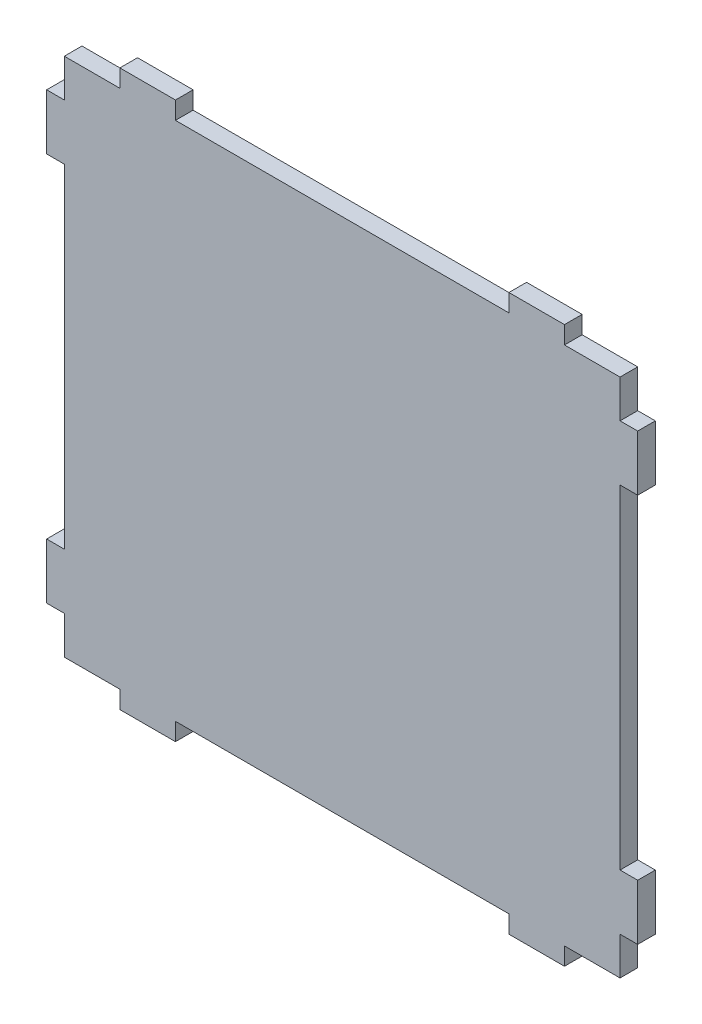
ISO-10303-21;
HEADER;
FILE_DESCRIPTION(('STEP AP214'),'2;1');
FILE_NAME('part.step','',(''),(''),'','','');
FILE_SCHEMA(('AUTOMOTIVE_DESIGN { 1 0 10303 214 1 1 1 1 }'));
ENDSEC;
DATA;
#1=APPLICATION_CONTEXT('core data for automotive mechanical design processes');
#2=APPLICATION_PROTOCOL_DEFINITION('international standard','automotive_design',2000,#1);
#3=PRODUCT_CONTEXT('',#1,'mechanical');
#4=PRODUCT('Part','Part','',(#3));
#5=PRODUCT_RELATED_PRODUCT_CATEGORY('part','',(#4));
#6=PRODUCT_DEFINITION_FORMATION('','',#4);
#7=PRODUCT_DEFINITION_CONTEXT('part definition',#1,'design');
#8=PRODUCT_DEFINITION('design','',#6,#7);
#9=PRODUCT_DEFINITION_SHAPE('','',#8);
#10=(LENGTH_UNIT() NAMED_UNIT(*) SI_UNIT(.MILLI.,.METRE.));
#11=(NAMED_UNIT(*) PLANE_ANGLE_UNIT() SI_UNIT($,.RADIAN.));
#12=(NAMED_UNIT(*) SI_UNIT($,.STERADIAN.) SOLID_ANGLE_UNIT());
#13=UNCERTAINTY_MEASURE_WITH_UNIT(LENGTH_MEASURE(1.E-05),#10,'distance_accuracy_value','');
#14=(GEOMETRIC_REPRESENTATION_CONTEXT(3) GLOBAL_UNCERTAINTY_ASSIGNED_CONTEXT((#13)) GLOBAL_UNIT_ASSIGNED_CONTEXT((#10,
#11,#12)) REPRESENTATION_CONTEXT('',''));
#15=CARTESIAN_POINT('',(0.,0.,0.));
#16=DIRECTION('',(0.,0.,1.));
#17=DIRECTION('',(1.,0.,0.));
#18=AXIS2_PLACEMENT_3D('',#15,#16,#17);
#19=CARTESIAN_POINT('',(10.,96.825,3.175));
#20=DIRECTION('',(1.,0.,0.));
#21=DIRECTION('',(0.,0.,-1.));
#22=AXIS2_PLACEMENT_3D('',#19,#20,#21);
#23=PLANE('',#22);
#24=DIRECTION('',(0.,-1.,0.));
#25=VECTOR('',#24,1.);
#26=CARTESIAN_POINT('',(10.,96.825,0.));
#27=LINE('',#26,#25);
#28=CARTESIAN_POINT('',(10.,100.,0.));
#29=VERTEX_POINT('',#28);
#30=CARTESIAN_POINT('',(10.,96.825,0.));
#31=VERTEX_POINT('',#30);
#32=EDGE_CURVE('E575',#29,#31,#27,.T.);
#33=ORIENTED_EDGE('',*,*,#32,.T.);
#34=DIRECTION('',(0.,0.,-1.));
#35=VECTOR('',#34,1.);
#36=CARTESIAN_POINT('',(10.,96.825,3.175));
#37=LINE('',#36,#35);
#38=CARTESIAN_POINT('',(10.,96.825,3.175));
#39=VERTEX_POINT('',#38);
#40=EDGE_CURVE('E12',#39,#31,#37,.T.);
#41=ORIENTED_EDGE('',*,*,#40,.F.);
#42=DIRECTION('',(0.,-1.,0.));
#43=VECTOR('',#42,1.);
#44=CARTESIAN_POINT('',(10.,96.825,3.175));
#45=LINE('',#44,#43);
#46=CARTESIAN_POINT('',(10.,100.,3.175));
#47=VERTEX_POINT('',#46);
#48=EDGE_CURVE('E456',#47,#39,#45,.T.);
#49=ORIENTED_EDGE('',*,*,#48,.F.);
#50=DIRECTION('',(0.,0.,-1.));
#51=VECTOR('',#50,1.);
#52=CARTESIAN_POINT('',(10.,100.,3.175));
#53=LINE('',#52,#51);
#54=EDGE_CURVE('E298',#47,#29,#53,.T.);
#55=ORIENTED_EDGE('',*,*,#54,.T.);
#56=EDGE_LOOP('',(#33,#41,#49,#55));
#57=FACE_BOUND('',#56,.T.);
#58=ADVANCED_FACE('F35',(#57),#23,.F.);
#59=CARTESIAN_POINT('',(10.,96.825,3.175));
#60=DIRECTION('',(0.,-1.,0.));
#61=DIRECTION('',(0.,0.,-1.));
#62=AXIS2_PLACEMENT_3D('',#59,#60,#61);
#63=PLANE('',#62);
#64=DIRECTION('',(-1.,0.,0.));
#65=VECTOR('',#64,1.);
#66=CARTESIAN_POINT('',(10.,96.825,0.));
#67=LINE('',#66,#65);
#68=CARTESIAN_POINT('',(0.,96.825,0.));
#69=VERTEX_POINT('',#68);
#70=EDGE_CURVE('E569',#31,#69,#67,.T.);
#71=ORIENTED_EDGE('',*,*,#70,.T.);
#72=DIRECTION('',(0.,0.,-1.));
#73=VECTOR('',#72,1.);
#74=CARTESIAN_POINT('',(0.,96.825,3.175));
#75=LINE('',#74,#73);
#76=CARTESIAN_POINT('',(0.,96.825,3.175));
#77=VERTEX_POINT('',#76);
#78=EDGE_CURVE('E43',#77,#69,#75,.T.);
#79=ORIENTED_EDGE('',*,*,#78,.F.);
#80=DIRECTION('',(-1.,0.,0.));
#81=VECTOR('',#80,1.);
#82=CARTESIAN_POINT('',(10.,96.825,3.175));
#83=LINE('',#82,#81);
#84=EDGE_CURVE('E178',#39,#77,#83,.T.);
#85=ORIENTED_EDGE('',*,*,#84,.F.);
#86=ORIENTED_EDGE('',*,*,#40,.T.);
#87=EDGE_LOOP('',(#71,#79,#85,#86));
#88=FACE_BOUND('',#87,.T.);
#89=ADVANCED_FACE('F652',(#88),#63,.F.);
#90=CARTESIAN_POINT('',(0.,90.,3.175));
#91=DIRECTION('',(1.,0.,0.));
#92=DIRECTION('',(0.,1.,0.));
#93=AXIS2_PLACEMENT_3D('',#90,#91,#92);
#94=PLANE('',#93);
#95=DIRECTION('',(0.,-1.,0.));
#96=VECTOR('',#95,1.);
#97=CARTESIAN_POINT('',(0.,90.,0.));
#98=LINE('',#97,#96);
#99=CARTESIAN_POINT('',(0.,90.,0.));
#100=VERTEX_POINT('',#99);
#101=EDGE_CURVE('E564',#69,#100,#98,.T.);
#102=ORIENTED_EDGE('',*,*,#101,.T.);
#103=DIRECTION('',(0.,0.,-1.));
#104=VECTOR('',#103,1.);
#105=CARTESIAN_POINT('',(0.,90.,3.175));
#106=LINE('',#105,#104);
#107=CARTESIAN_POINT('',(0.,90.,3.175));
#108=VERTEX_POINT('',#107);
#109=EDGE_CURVE('E556',#108,#100,#106,.T.);
#110=ORIENTED_EDGE('',*,*,#109,.F.);
#111=DIRECTION('',(0.,-1.,0.));
#112=VECTOR('',#111,1.);
#113=CARTESIAN_POINT('',(0.,90.,3.175));
#114=LINE('',#113,#112);
#115=EDGE_CURVE('E448',#77,#108,#114,.T.);
#116=ORIENTED_EDGE('',*,*,#115,.F.);
#117=ORIENTED_EDGE('',*,*,#78,.T.);
#118=EDGE_LOOP('',(#102,#110,#116,#117));
#119=FACE_BOUND('',#118,.T.);
#120=ADVANCED_FACE('F562',(#119),#94,.F.);
#121=CARTESIAN_POINT('',(0.,90.,3.175));
#122=DIRECTION('',(0.,-1.,0.));
#123=DIRECTION('',(0.,0.,-1.));
#124=AXIS2_PLACEMENT_3D('',#121,#122,#123);
#125=PLANE('',#124);
#126=DIRECTION('',(-1.,0.,0.));
#127=VECTOR('',#126,1.);
#128=CARTESIAN_POINT('',(0.,90.,0.));
#129=LINE('',#128,#127);
#130=CARTESIAN_POINT('',(-3.175,90.,0.));
#131=VERTEX_POINT('',#130);
#132=EDGE_CURVE('E571',#100,#131,#129,.T.);
#133=ORIENTED_EDGE('',*,*,#132,.T.);
#134=DIRECTION('',(0.,0.,-1.));
#135=VECTOR('',#134,1.);
#136=CARTESIAN_POINT('',(-3.175,90.,3.175));
#137=LINE('',#136,#135);
#138=CARTESIAN_POINT('',(-3.175,90.,3.175));
#139=VERTEX_POINT('',#138);
#140=EDGE_CURVE('E553',#139,#131,#137,.T.);
#141=ORIENTED_EDGE('',*,*,#140,.F.);
#142=DIRECTION('',(-1.,0.,0.));
#143=VECTOR('',#142,1.);
#144=CARTESIAN_POINT('',(0.,90.,3.175));
#145=LINE('',#144,#143);
#146=EDGE_CURVE('E444',#108,#139,#145,.T.);
#147=ORIENTED_EDGE('',*,*,#146,.F.);
#148=ORIENTED_EDGE('',*,*,#109,.T.);
#149=EDGE_LOOP('',(#133,#141,#147,#148));
#150=FACE_BOUND('',#149,.T.);
#151=ADVANCED_FACE('F659',(#150),#125,.F.);
#152=CARTESIAN_POINT('',(-3.175,90.,3.175));
#153=DIRECTION('',(1.,0.,0.));
#154=DIRECTION('',(0.,1.,0.));
#155=AXIS2_PLACEMENT_3D('',#152,#153,#154);
#156=PLANE('',#155);
#157=DIRECTION('',(0.,-1.,0.));
#158=VECTOR('',#157,1.);
#159=CARTESIAN_POINT('',(-3.175,90.,0.));
#160=LINE('',#159,#158);
#161=CARTESIAN_POINT('',(-3.175,80.,0.));
#162=VERTEX_POINT('',#161);
#163=EDGE_CURVE('E573',#131,#162,#160,.T.);
#164=ORIENTED_EDGE('',*,*,#163,.T.);
#165=DIRECTION('',(0.,0.,-1.));
#166=VECTOR('',#165,1.);
#167=CARTESIAN_POINT('',(-3.175,80.,3.175));
#168=LINE('',#167,#166);
#169=CARTESIAN_POINT('',(-3.175,80.,3.175));
#170=VERTEX_POINT('',#169);
#171=EDGE_CURVE('E550',#170,#162,#168,.T.);
#172=ORIENTED_EDGE('',*,*,#171,.F.);
#173=DIRECTION('',(0.,-1.,0.));
#174=VECTOR('',#173,1.);
#175=CARTESIAN_POINT('',(-3.175,90.,3.175));
#176=LINE('',#175,#174);
#177=EDGE_CURVE('E441',#139,#170,#176,.T.);
#178=ORIENTED_EDGE('',*,*,#177,.F.);
#179=ORIENTED_EDGE('',*,*,#140,.T.);
#180=EDGE_LOOP('',(#164,#172,#178,#179));
#181=FACE_BOUND('',#180,.T.);
#182=ADVANCED_FACE('F664',(#181),#156,.F.);
#183=CARTESIAN_POINT('',(0.,80.,3.175));
#184=DIRECTION('',(0.,1.,0.));
#185=DIRECTION('',(0.,0.,1.));
#186=AXIS2_PLACEMENT_3D('',#183,#184,#185);
#187=PLANE('',#186);
#188=DIRECTION('',(1.,0.,0.));
#189=VECTOR('',#188,1.);
#190=CARTESIAN_POINT('',(0.,80.,0.));
#191=LINE('',#190,#189);
#192=CARTESIAN_POINT('',(0.,80.,0.));
#193=VERTEX_POINT('',#192);
#194=EDGE_CURVE('E579',#162,#193,#191,.T.);
#195=ORIENTED_EDGE('',*,*,#194,.T.);
#196=DIRECTION('',(0.,0.,-1.));
#197=VECTOR('',#196,1.);
#198=CARTESIAN_POINT('',(0.,80.,3.175));
#199=LINE('',#198,#197);
#200=CARTESIAN_POINT('',(0.,80.,3.175));
#201=VERTEX_POINT('',#200);
#202=EDGE_CURVE('E547',#201,#193,#199,.T.);
#203=ORIENTED_EDGE('',*,*,#202,.F.);
#204=DIRECTION('',(1.,0.,0.));
#205=VECTOR('',#204,1.);
#206=CARTESIAN_POINT('',(0.,80.,3.175));
#207=LINE('',#206,#205);
#208=EDGE_CURVE('E433',#170,#201,#207,.T.);
#209=ORIENTED_EDGE('',*,*,#208,.F.);
#210=ORIENTED_EDGE('',*,*,#171,.T.);
#211=EDGE_LOOP('',(#195,#203,#209,#210));
#212=FACE_BOUND('',#211,.T.);
#213=ADVANCED_FACE('F668',(#212),#187,.F.);
#214=CARTESIAN_POINT('',(0.,80.,3.175));
#215=DIRECTION('',(1.,0.,0.));
#216=DIRECTION('',(0.,0.,-1.));
#217=AXIS2_PLACEMENT_3D('',#214,#215,#216);
#218=PLANE('',#217);
#219=DIRECTION('',(0.,-1.,0.));
#220=VECTOR('',#219,1.);
#221=CARTESIAN_POINT('',(0.,80.,0.));
#222=LINE('',#221,#220);
#223=CARTESIAN_POINT('',(0.,20.,0.));
#224=VERTEX_POINT('',#223);
#225=EDGE_CURVE('E581',#193,#224,#222,.T.);
#226=ORIENTED_EDGE('',*,*,#225,.T.);
#227=DIRECTION('',(0.,0.,-1.));
#228=VECTOR('',#227,1.);
#229=CARTESIAN_POINT('',(0.,20.,3.175));
#230=LINE('',#229,#228);
#231=CARTESIAN_POINT('',(0.,20.,3.175));
#232=VERTEX_POINT('',#231);
#233=EDGE_CURVE('E544',#232,#224,#230,.T.);
#234=ORIENTED_EDGE('',*,*,#233,.F.);
#235=DIRECTION('',(0.,-1.,0.));
#236=VECTOR('',#235,1.);
#237=CARTESIAN_POINT('',(0.,80.,3.175));
#238=LINE('',#237,#236);
#239=EDGE_CURVE('E429',#201,#232,#238,.T.);
#240=ORIENTED_EDGE('',*,*,#239,.F.);
#241=ORIENTED_EDGE('',*,*,#202,.T.);
#242=EDGE_LOOP('',(#226,#234,#240,#241));
#243=FACE_BOUND('',#242,.T.);
#244=ADVANCED_FACE('F672',(#243),#218,.F.);
#245=CARTESIAN_POINT('',(0.,20.,3.175));
#246=DIRECTION('',(0.,-1.,0.));
#247=DIRECTION('',(0.,0.,-1.));
#248=AXIS2_PLACEMENT_3D('',#245,#246,#247);
#249=PLANE('',#248);
#250=DIRECTION('',(-1.,0.,0.));
#251=VECTOR('',#250,1.);
#252=CARTESIAN_POINT('',(0.,20.,0.));
#253=LINE('',#252,#251);
#254=CARTESIAN_POINT('',(-3.175,20.,0.));
#255=VERTEX_POINT('',#254);
#256=EDGE_CURVE('E583',#224,#255,#253,.T.);
#257=ORIENTED_EDGE('',*,*,#256,.T.);
#258=DIRECTION('',(0.,0.,-1.));
#259=VECTOR('',#258,1.);
#260=CARTESIAN_POINT('',(-3.175,20.,3.175));
#261=LINE('',#260,#259);
#262=CARTESIAN_POINT('',(-3.175,20.,3.175));
#263=VERTEX_POINT('',#262);
#264=EDGE_CURVE('E541',#263,#255,#261,.T.);
#265=ORIENTED_EDGE('',*,*,#264,.F.);
#266=DIRECTION('',(-1.,0.,0.));
#267=VECTOR('',#266,1.);
#268=CARTESIAN_POINT('',(0.,20.,3.175));
#269=LINE('',#268,#267);
#270=EDGE_CURVE('E425',#232,#263,#269,.T.);
#271=ORIENTED_EDGE('',*,*,#270,.F.);
#272=ORIENTED_EDGE('',*,*,#233,.T.);
#273=EDGE_LOOP('',(#257,#265,#271,#272));
#274=FACE_BOUND('',#273,.T.);
#275=ADVANCED_FACE('F676',(#274),#249,.F.);
#276=CARTESIAN_POINT('',(-3.175,9.99999999999999,3.175));
#277=DIRECTION('',(1.,0.,0.));
#278=DIRECTION('',(0.,1.,0.));
#279=AXIS2_PLACEMENT_3D('',#276,#277,#278);
#280=PLANE('',#279);
#281=DIRECTION('',(0.,-1.,0.));
#282=VECTOR('',#281,1.);
#283=CARTESIAN_POINT('',(-3.175,9.99999999999999,0.));
#284=LINE('',#283,#282);
#285=CARTESIAN_POINT('',(-3.175,9.99999999999999,0.));
#286=VERTEX_POINT('',#285);
#287=EDGE_CURVE('E585',#255,#286,#284,.T.);
#288=ORIENTED_EDGE('',*,*,#287,.T.);
#289=DIRECTION('',(0.,0.,-1.));
#290=VECTOR('',#289,1.);
#291=CARTESIAN_POINT('',(-3.175,9.99999999999999,3.175));
#292=LINE('',#291,#290);
#293=CARTESIAN_POINT('',(-3.175,9.99999999999999,3.175));
#294=VERTEX_POINT('',#293);
#295=EDGE_CURVE('E538',#294,#286,#292,.T.);
#296=ORIENTED_EDGE('',*,*,#295,.F.);
#297=DIRECTION('',(0.,-1.,0.));
#298=VECTOR('',#297,1.);
#299=CARTESIAN_POINT('',(-3.175,9.99999999999999,3.175));
#300=LINE('',#299,#298);
#301=EDGE_CURVE('E422',#263,#294,#300,.T.);
#302=ORIENTED_EDGE('',*,*,#301,.F.);
#303=ORIENTED_EDGE('',*,*,#264,.T.);
#304=EDGE_LOOP('',(#288,#296,#302,#303));
#305=FACE_BOUND('',#304,.T.);
#306=ADVANCED_FACE('F680',(#305),#280,.F.);
#307=CARTESIAN_POINT('',(0.,9.99999999999999,3.175));
#308=DIRECTION('',(0.,1.,0.));
#309=DIRECTION('',(0.,0.,1.));
#310=AXIS2_PLACEMENT_3D('',#307,#308,#309);
#311=PLANE('',#310);
#312=DIRECTION('',(1.,0.,0.));
#313=VECTOR('',#312,1.);
#314=CARTESIAN_POINT('',(0.,9.99999999999999,0.));
#315=LINE('',#314,#313);
#316=CARTESIAN_POINT('',(0.,9.99999999999999,0.));
#317=VERTEX_POINT('',#316);
#318=EDGE_CURVE('E587',#286,#317,#315,.T.);
#319=ORIENTED_EDGE('',*,*,#318,.T.);
#320=DIRECTION('',(0.,0.,-1.));
#321=VECTOR('',#320,1.);
#322=CARTESIAN_POINT('',(0.,9.99999999999999,3.175));
#323=LINE('',#322,#321);
#324=CARTESIAN_POINT('',(0.,9.99999999999999,3.175));
#325=VERTEX_POINT('',#324);
#326=EDGE_CURVE('E535',#325,#317,#323,.T.);
#327=ORIENTED_EDGE('',*,*,#326,.F.);
#328=DIRECTION('',(1.,0.,0.));
#329=VECTOR('',#328,1.);
#330=CARTESIAN_POINT('',(0.,9.99999999999999,3.175));
#331=LINE('',#330,#329);
#332=EDGE_CURVE('E414',#294,#325,#331,.T.);
#333=ORIENTED_EDGE('',*,*,#332,.F.);
#334=ORIENTED_EDGE('',*,*,#295,.T.);
#335=EDGE_LOOP('',(#319,#327,#333,#334));
#336=FACE_BOUND('',#335,.T.);
#337=ADVANCED_FACE('F684',(#336),#311,.F.);
#338=CARTESIAN_POINT('',(0.,9.99999999999999,3.175));
#339=DIRECTION('',(1.,0.,0.));
#340=DIRECTION('',(0.,1.,0.));
#341=AXIS2_PLACEMENT_3D('',#338,#339,#340);
#342=PLANE('',#341);
#343=DIRECTION('',(0.,-1.,0.));
#344=VECTOR('',#343,1.);
#345=CARTESIAN_POINT('',(0.,9.99999999999999,0.));
#346=LINE('',#345,#344);
#347=CARTESIAN_POINT('',(0.,3.175,0.));
#348=VERTEX_POINT('',#347);
#349=EDGE_CURVE('E589',#317,#348,#346,.T.);
#350=ORIENTED_EDGE('',*,*,#349,.T.);
#351=DIRECTION('',(0.,0.,-1.));
#352=VECTOR('',#351,1.);
#353=CARTESIAN_POINT('',(0.,3.175,3.175));
#354=LINE('',#353,#352);
#355=CARTESIAN_POINT('',(0.,3.175,3.175));
#356=VERTEX_POINT('',#355);
#357=EDGE_CURVE('E532',#356,#348,#354,.T.);
#358=ORIENTED_EDGE('',*,*,#357,.F.);
#359=DIRECTION('',(0.,-1.,0.));
#360=VECTOR('',#359,1.);
#361=CARTESIAN_POINT('',(0.,9.99999999999999,3.175));
#362=LINE('',#361,#360);
#363=EDGE_CURVE('E410',#325,#356,#362,.T.);
#364=ORIENTED_EDGE('',*,*,#363,.F.);
#365=ORIENTED_EDGE('',*,*,#326,.T.);
#366=EDGE_LOOP('',(#350,#358,#364,#365));
#367=FACE_BOUND('',#366,.T.);
#368=ADVANCED_FACE('F688',(#367),#342,.F.);
#369=CARTESIAN_POINT('',(10.,3.175,3.175));
#370=DIRECTION('',(0.,1.,0.));
#371=DIRECTION('',(-1.,0.,0.));
#372=AXIS2_PLACEMENT_3D('',#369,#370,#371);
#373=PLANE('',#372);
#374=DIRECTION('',(1.,0.,0.));
#375=VECTOR('',#374,1.);
#376=CARTESIAN_POINT('',(10.,3.175,0.));
#377=LINE('',#376,#375);
#378=CARTESIAN_POINT('',(10.,3.175,0.));
#379=VERTEX_POINT('',#378);
#380=EDGE_CURVE('E591',#348,#379,#377,.T.);
#381=ORIENTED_EDGE('',*,*,#380,.T.);
#382=DIRECTION('',(0.,0.,-1.));
#383=VECTOR('',#382,1.);
#384=CARTESIAN_POINT('',(10.,3.175,3.175));
#385=LINE('',#384,#383);
#386=CARTESIAN_POINT('',(10.,3.175,3.175));
#387=VERTEX_POINT('',#386);
#388=EDGE_CURVE('E529',#387,#379,#385,.T.);
#389=ORIENTED_EDGE('',*,*,#388,.F.);
#390=DIRECTION('',(1.,0.,0.));
#391=VECTOR('',#390,1.);
#392=CARTESIAN_POINT('',(10.,3.175,3.175));
#393=LINE('',#392,#391);
#394=EDGE_CURVE('E406',#356,#387,#393,.T.);
#395=ORIENTED_EDGE('',*,*,#394,.F.);
#396=ORIENTED_EDGE('',*,*,#357,.T.);
#397=EDGE_LOOP('',(#381,#389,#395,#396));
#398=FACE_BOUND('',#397,.T.);
#399=ADVANCED_FACE('F692',(#398),#373,.F.);
#400=CARTESIAN_POINT('',(10.,3.175,3.175));
#401=DIRECTION('',(1.,0.,0.));
#402=DIRECTION('',(0.,0.,-1.));
#403=AXIS2_PLACEMENT_3D('',#400,#401,#402);
#404=PLANE('',#403);
#405=DIRECTION('',(0.,-1.,0.));
#406=VECTOR('',#405,1.);
#407=CARTESIAN_POINT('',(10.,3.175,0.));
#408=LINE('',#407,#406);
#409=CARTESIAN_POINT('',(10.,0.,0.));
#410=VERTEX_POINT('',#409);
#411=EDGE_CURVE('E593',#379,#410,#408,.T.);
#412=ORIENTED_EDGE('',*,*,#411,.T.);
#413=DIRECTION('',(0.,0.,-1.));
#414=VECTOR('',#413,1.);
#415=CARTESIAN_POINT('',(10.,0.,3.175));
#416=LINE('',#415,#414);
#417=CARTESIAN_POINT('',(10.,0.,3.175));
#418=VERTEX_POINT('',#417);
#419=EDGE_CURVE('E526',#418,#410,#416,.T.);
#420=ORIENTED_EDGE('',*,*,#419,.F.);
#421=DIRECTION('',(0.,-1.,0.));
#422=VECTOR('',#421,1.);
#423=CARTESIAN_POINT('',(10.,3.175,3.175));
#424=LINE('',#423,#422);
#425=EDGE_CURVE('E403',#387,#418,#424,.T.);
#426=ORIENTED_EDGE('',*,*,#425,.F.);
#427=ORIENTED_EDGE('',*,*,#388,.T.);
#428=EDGE_LOOP('',(#412,#420,#426,#427));
#429=FACE_BOUND('',#428,.T.);
#430=ADVANCED_FACE('F696',(#429),#404,.F.);
#431=CARTESIAN_POINT('',(10.,0.,3.175));
#432=DIRECTION('',(0.,1.,0.));
#433=DIRECTION('',(0.,0.,1.));
#434=AXIS2_PLACEMENT_3D('',#431,#432,#433);
#435=PLANE('',#434);
#436=DIRECTION('',(1.,0.,0.));
#437=VECTOR('',#436,1.);
#438=CARTESIAN_POINT('',(10.,0.,0.));
#439=LINE('',#438,#437);
#440=CARTESIAN_POINT('',(20.,0.,0.));
#441=VERTEX_POINT('',#440);
#442=EDGE_CURVE('E595',#410,#441,#439,.T.);
#443=ORIENTED_EDGE('',*,*,#442,.T.);
#444=DIRECTION('',(0.,0.,-1.));
#445=VECTOR('',#444,1.);
#446=CARTESIAN_POINT('',(20.,0.,3.175));
#447=LINE('',#446,#445);
#448=CARTESIAN_POINT('',(20.,0.,3.175));
#449=VERTEX_POINT('',#448);
#450=EDGE_CURVE('E523',#449,#441,#447,.T.);
#451=ORIENTED_EDGE('',*,*,#450,.F.);
#452=DIRECTION('',(1.,0.,0.));
#453=VECTOR('',#452,1.);
#454=CARTESIAN_POINT('',(10.,0.,3.175));
#455=LINE('',#454,#453);
#456=EDGE_CURVE('E395',#418,#449,#455,.T.);
#457=ORIENTED_EDGE('',*,*,#456,.F.);
#458=ORIENTED_EDGE('',*,*,#419,.T.);
#459=EDGE_LOOP('',(#443,#451,#457,#458));
#460=FACE_BOUND('',#459,.T.);
#461=ADVANCED_FACE('F700',(#460),#435,.F.);
#462=CARTESIAN_POINT('',(20.,3.175,3.175));
#463=DIRECTION('',(-1.,0.,0.));
#464=DIRECTION('',(0.,0.,1.));
#465=AXIS2_PLACEMENT_3D('',#462,#463,#464);
#466=PLANE('',#465);
#467=DIRECTION('',(0.,1.,0.));
#468=VECTOR('',#467,1.);
#469=CARTESIAN_POINT('',(20.,3.175,0.));
#470=LINE('',#469,#468);
#471=CARTESIAN_POINT('',(20.,3.175,0.));
#472=VERTEX_POINT('',#471);
#473=EDGE_CURVE('E597',#441,#472,#470,.T.);
#474=ORIENTED_EDGE('',*,*,#473,.T.);
#475=DIRECTION('',(0.,0.,-1.));
#476=VECTOR('',#475,1.);
#477=CARTESIAN_POINT('',(20.,3.175,3.175));
#478=LINE('',#477,#476);
#479=CARTESIAN_POINT('',(20.,3.175,3.175));
#480=VERTEX_POINT('',#479);
#481=EDGE_CURVE('E520',#480,#472,#478,.T.);
#482=ORIENTED_EDGE('',*,*,#481,.F.);
#483=DIRECTION('',(0.,1.,0.));
#484=VECTOR('',#483,1.);
#485=CARTESIAN_POINT('',(20.,3.175,3.175));
#486=LINE('',#485,#484);
#487=EDGE_CURVE('E391',#449,#480,#486,.T.);
#488=ORIENTED_EDGE('',*,*,#487,.F.);
#489=ORIENTED_EDGE('',*,*,#450,.T.);
#490=EDGE_LOOP('',(#474,#482,#488,#489));
#491=FACE_BOUND('',#490,.T.);
#492=ADVANCED_FACE('F704',(#491),#466,.F.);
#493=CARTESIAN_POINT('',(20.,3.175,3.175));
#494=DIRECTION('',(0.,1.,0.));
#495=DIRECTION('',(0.,0.,1.));
#496=AXIS2_PLACEMENT_3D('',#493,#494,#495);
#497=PLANE('',#496);
#498=DIRECTION('',(1.,0.,0.));
#499=VECTOR('',#498,1.);
#500=CARTESIAN_POINT('',(20.,3.175,0.));
#501=LINE('',#500,#499);
#502=CARTESIAN_POINT('',(80.,3.175,0.));
#503=VERTEX_POINT('',#502);
#504=EDGE_CURVE('E599',#472,#503,#501,.T.);
#505=ORIENTED_EDGE('',*,*,#504,.T.);
#506=DIRECTION('',(0.,0.,-1.));
#507=VECTOR('',#506,1.);
#508=CARTESIAN_POINT('',(80.,3.175,3.175));
#509=LINE('',#508,#507);
#510=CARTESIAN_POINT('',(80.,3.175,3.175));
#511=VERTEX_POINT('',#510);
#512=EDGE_CURVE('E517',#511,#503,#509,.T.);
#513=ORIENTED_EDGE('',*,*,#512,.F.);
#514=DIRECTION('',(1.,0.,0.));
#515=VECTOR('',#514,1.);
#516=CARTESIAN_POINT('',(20.,3.175,3.175));
#517=LINE('',#516,#515);
#518=EDGE_CURVE('E387',#480,#511,#517,.T.);
#519=ORIENTED_EDGE('',*,*,#518,.F.);
#520=ORIENTED_EDGE('',*,*,#481,.T.);
#521=EDGE_LOOP('',(#505,#513,#519,#520));
#522=FACE_BOUND('',#521,.T.);
#523=ADVANCED_FACE('F708',(#522),#497,.F.);
#524=CARTESIAN_POINT('',(80.,3.175,3.175));
#525=DIRECTION('',(1.,0.,0.));
#526=DIRECTION('',(0.,0.,-1.));
#527=AXIS2_PLACEMENT_3D('',#524,#525,#526);
#528=PLANE('',#527);
#529=DIRECTION('',(0.,-1.,0.));
#530=VECTOR('',#529,1.);
#531=CARTESIAN_POINT('',(80.,3.175,0.));
#532=LINE('',#531,#530);
#533=CARTESIAN_POINT('',(80.,0.,0.));
#534=VERTEX_POINT('',#533);
#535=EDGE_CURVE('E601',#503,#534,#532,.T.);
#536=ORIENTED_EDGE('',*,*,#535,.T.);
#537=DIRECTION('',(0.,0.,-1.));
#538=VECTOR('',#537,1.);
#539=CARTESIAN_POINT('',(80.,0.,3.175));
#540=LINE('',#539,#538);
#541=CARTESIAN_POINT('',(80.,0.,3.175));
#542=VERTEX_POINT('',#541);
#543=EDGE_CURVE('E514',#542,#534,#540,.T.);
#544=ORIENTED_EDGE('',*,*,#543,.F.);
#545=DIRECTION('',(0.,-1.,0.));
#546=VECTOR('',#545,1.);
#547=CARTESIAN_POINT('',(80.,3.175,3.175));
#548=LINE('',#547,#546);
#549=EDGE_CURVE('E384',#511,#542,#548,.T.);
#550=ORIENTED_EDGE('',*,*,#549,.F.);
#551=ORIENTED_EDGE('',*,*,#512,.T.);
#552=EDGE_LOOP('',(#536,#544,#550,#551));
#553=FACE_BOUND('',#552,.T.);
#554=ADVANCED_FACE('F712',(#553),#528,.F.);
#555=CARTESIAN_POINT('',(90.,0.,3.175));
#556=DIRECTION('',(0.,1.,0.));
#557=DIRECTION('',(0.,0.,1.));
#558=AXIS2_PLACEMENT_3D('',#555,#556,#557);
#559=PLANE('',#558);
#560=DIRECTION('',(1.,0.,0.));
#561=VECTOR('',#560,1.);
#562=CARTESIAN_POINT('',(90.,0.,0.));
#563=LINE('',#562,#561);
#564=CARTESIAN_POINT('',(90.,0.,0.));
#565=VERTEX_POINT('',#564);
#566=EDGE_CURVE('E603',#534,#565,#563,.T.);
#567=ORIENTED_EDGE('',*,*,#566,.T.);
#568=DIRECTION('',(0.,0.,-1.));
#569=VECTOR('',#568,1.);
#570=CARTESIAN_POINT('',(90.,0.,3.175));
#571=LINE('',#570,#569);
#572=CARTESIAN_POINT('',(90.,0.,3.175));
#573=VERTEX_POINT('',#572);
#574=EDGE_CURVE('E511',#573,#565,#571,.T.);
#575=ORIENTED_EDGE('',*,*,#574,.F.);
#576=DIRECTION('',(1.,0.,0.));
#577=VECTOR('',#576,1.);
#578=CARTESIAN_POINT('',(90.,0.,3.175));
#579=LINE('',#578,#577);
#580=EDGE_CURVE('E376',#542,#573,#579,.T.);
#581=ORIENTED_EDGE('',*,*,#580,.F.);
#582=ORIENTED_EDGE('',*,*,#543,.T.);
#583=EDGE_LOOP('',(#567,#575,#581,#582));
#584=FACE_BOUND('',#583,.T.);
#585=ADVANCED_FACE('F716',(#584),#559,.F.);
#586=CARTESIAN_POINT('',(90.,3.175,3.175));
#587=DIRECTION('',(-1.,0.,0.));
#588=DIRECTION('',(0.,0.,1.));
#589=AXIS2_PLACEMENT_3D('',#586,#587,#588);
#590=PLANE('',#589);
#591=DIRECTION('',(0.,1.,0.));
#592=VECTOR('',#591,1.);
#593=CARTESIAN_POINT('',(90.,3.175,0.));
#594=LINE('',#593,#592);
#595=CARTESIAN_POINT('',(90.,3.175,0.));
#596=VERTEX_POINT('',#595);
#597=EDGE_CURVE('E605',#565,#596,#594,.T.);
#598=ORIENTED_EDGE('',*,*,#597,.T.);
#599=DIRECTION('',(0.,0.,-1.));
#600=VECTOR('',#599,1.);
#601=CARTESIAN_POINT('',(90.,3.175,3.175));
#602=LINE('',#601,#600);
#603=CARTESIAN_POINT('',(90.,3.175,3.175));
#604=VERTEX_POINT('',#603);
#605=EDGE_CURVE('E508',#604,#596,#602,.T.);
#606=ORIENTED_EDGE('',*,*,#605,.F.);
#607=DIRECTION('',(0.,1.,0.));
#608=VECTOR('',#607,1.);
#609=CARTESIAN_POINT('',(90.,3.175,3.175));
#610=LINE('',#609,#608);
#611=EDGE_CURVE('E372',#573,#604,#610,.T.);
#612=ORIENTED_EDGE('',*,*,#611,.F.);
#613=ORIENTED_EDGE('',*,*,#574,.T.);
#614=EDGE_LOOP('',(#598,#606,#612,#613));
#615=FACE_BOUND('',#614,.T.);
#616=ADVANCED_FACE('F720',(#615),#590,.F.);
#617=CARTESIAN_POINT('',(90.,3.175,3.175));
#618=DIRECTION('',(0.,1.,0.));
#619=DIRECTION('',(0.,0.,1.));
#620=AXIS2_PLACEMENT_3D('',#617,#618,#619);
#621=PLANE('',#620);
#622=DIRECTION('',(1.,0.,0.));
#623=VECTOR('',#622,1.);
#624=CARTESIAN_POINT('',(90.,3.175,0.));
#625=LINE('',#624,#623);
#626=CARTESIAN_POINT('',(100.,3.175,0.));
#627=VERTEX_POINT('',#626);
#628=EDGE_CURVE('E607',#596,#627,#625,.T.);
#629=ORIENTED_EDGE('',*,*,#628,.T.);
#630=DIRECTION('',(0.,0.,-1.));
#631=VECTOR('',#630,1.);
#632=CARTESIAN_POINT('',(100.,3.175,3.175));
#633=LINE('',#632,#631);
#634=CARTESIAN_POINT('',(100.,3.175,3.175));
#635=VERTEX_POINT('',#634);
#636=EDGE_CURVE('E505',#635,#627,#633,.T.);
#637=ORIENTED_EDGE('',*,*,#636,.F.);
#638=DIRECTION('',(1.,0.,0.));
#639=VECTOR('',#638,1.);
#640=CARTESIAN_POINT('',(90.,3.175,3.175));
#641=LINE('',#640,#639);
#642=EDGE_CURVE('E368',#604,#635,#641,.T.);
#643=ORIENTED_EDGE('',*,*,#642,.F.);
#644=ORIENTED_EDGE('',*,*,#605,.T.);
#645=EDGE_LOOP('',(#629,#637,#643,#644));
#646=FACE_BOUND('',#645,.T.);
#647=ADVANCED_FACE('F724',(#646),#621,.F.);
#648=CARTESIAN_POINT('',(100.,9.99999999999999,3.175));
#649=DIRECTION('',(-1.,0.,0.));
#650=DIRECTION('',(0.,0.,1.));
#651=AXIS2_PLACEMENT_3D('',#648,#649,#650);
#652=PLANE('',#651);
#653=DIRECTION('',(0.,1.,0.));
#654=VECTOR('',#653,1.);
#655=CARTESIAN_POINT('',(100.,9.99999999999999,0.));
#656=LINE('',#655,#654);
#657=CARTESIAN_POINT('',(100.,9.99999999999999,0.));
#658=VERTEX_POINT('',#657);
#659=EDGE_CURVE('E609',#627,#658,#656,.T.);
#660=ORIENTED_EDGE('',*,*,#659,.T.);
#661=DIRECTION('',(0.,0.,-1.));
#662=VECTOR('',#661,1.);
#663=CARTESIAN_POINT('',(100.,9.99999999999999,3.175));
#664=LINE('',#663,#662);
#665=CARTESIAN_POINT('',(100.,9.99999999999999,3.175));
#666=VERTEX_POINT('',#665);
#667=EDGE_CURVE('E502',#666,#658,#664,.T.);
#668=ORIENTED_EDGE('',*,*,#667,.F.);
#669=DIRECTION('',(0.,1.,0.));
#670=VECTOR('',#669,1.);
#671=CARTESIAN_POINT('',(100.,9.99999999999999,3.175));
#672=LINE('',#671,#670);
#673=EDGE_CURVE('E365',#635,#666,#672,.T.);
#674=ORIENTED_EDGE('',*,*,#673,.F.);
#675=ORIENTED_EDGE('',*,*,#636,.T.);
#676=EDGE_LOOP('',(#660,#668,#674,#675));
#677=FACE_BOUND('',#676,.T.);
#678=ADVANCED_FACE('F728',(#677),#652,.F.);
#679=CARTESIAN_POINT('',(100.,9.99999999999999,3.175));
#680=DIRECTION('',(0.,1.,0.));
#681=DIRECTION('',(0.,0.,1.));
#682=AXIS2_PLACEMENT_3D('',#679,#680,#681);
#683=PLANE('',#682);
#684=DIRECTION('',(1.,0.,0.));
#685=VECTOR('',#684,1.);
#686=CARTESIAN_POINT('',(100.,9.99999999999999,0.));
#687=LINE('',#686,#685);
#688=CARTESIAN_POINT('',(103.175,9.99999999999999,0.));
#689=VERTEX_POINT('',#688);
#690=EDGE_CURVE('E611',#658,#689,#687,.T.);
#691=ORIENTED_EDGE('',*,*,#690,.T.);
#692=DIRECTION('',(0.,0.,-1.));
#693=VECTOR('',#692,1.);
#694=CARTESIAN_POINT('',(103.175,9.99999999999999,3.175));
#695=LINE('',#694,#693);
#696=CARTESIAN_POINT('',(103.175,9.99999999999999,3.175));
#697=VERTEX_POINT('',#696);
#698=EDGE_CURVE('E499',#697,#689,#695,.T.);
#699=ORIENTED_EDGE('',*,*,#698,.F.);
#700=DIRECTION('',(1.,0.,0.));
#701=VECTOR('',#700,1.);
#702=CARTESIAN_POINT('',(100.,9.99999999999999,3.175));
#703=LINE('',#702,#701);
#704=EDGE_CURVE('E357',#666,#697,#703,.T.);
#705=ORIENTED_EDGE('',*,*,#704,.F.);
#706=ORIENTED_EDGE('',*,*,#667,.T.);
#707=EDGE_LOOP('',(#691,#699,#705,#706));
#708=FACE_BOUND('',#707,.T.);
#709=ADVANCED_FACE('F732',(#708),#683,.F.);
#710=CARTESIAN_POINT('',(103.175,9.99999999999999,3.175));
#711=DIRECTION('',(-1.,0.,0.));
#712=DIRECTION('',(0.,0.,1.));
#713=AXIS2_PLACEMENT_3D('',#710,#711,#712);
#714=PLANE('',#713);
#715=DIRECTION('',(0.,1.,0.));
#716=VECTOR('',#715,1.);
#717=CARTESIAN_POINT('',(103.175,9.99999999999999,0.));
#718=LINE('',#717,#716);
#719=CARTESIAN_POINT('',(103.175,20.,0.));
#720=VERTEX_POINT('',#719);
#721=EDGE_CURVE('E613',#689,#720,#718,.T.);
#722=ORIENTED_EDGE('',*,*,#721,.T.);
#723=DIRECTION('',(0.,0.,-1.));
#724=VECTOR('',#723,1.);
#725=CARTESIAN_POINT('',(103.175,20.,3.175));
#726=LINE('',#725,#724);
#727=CARTESIAN_POINT('',(103.175,20.,3.175));
#728=VERTEX_POINT('',#727);
#729=EDGE_CURVE('E496',#728,#720,#726,.T.);
#730=ORIENTED_EDGE('',*,*,#729,.F.);
#731=DIRECTION('',(0.,1.,0.));
#732=VECTOR('',#731,1.);
#733=CARTESIAN_POINT('',(103.175,9.99999999999999,3.175));
#734=LINE('',#733,#732);
#735=EDGE_CURVE('E353',#697,#728,#734,.T.);
#736=ORIENTED_EDGE('',*,*,#735,.F.);
#737=ORIENTED_EDGE('',*,*,#698,.T.);
#738=EDGE_LOOP('',(#722,#730,#736,#737));
#739=FACE_BOUND('',#738,.T.);
#740=ADVANCED_FACE('F736',(#739),#714,.F.);
#741=CARTESIAN_POINT('',(100.,20.,3.175));
#742=DIRECTION('',(0.,-1.,0.));
#743=DIRECTION('',(0.,0.,-1.));
#744=AXIS2_PLACEMENT_3D('',#741,#742,#743);
#745=PLANE('',#744);
#746=DIRECTION('',(-1.,0.,0.));
#747=VECTOR('',#746,1.);
#748=CARTESIAN_POINT('',(100.,20.,0.));
#749=LINE('',#748,#747);
#750=CARTESIAN_POINT('',(100.,20.,0.));
#751=VERTEX_POINT('',#750);
#752=EDGE_CURVE('E615',#720,#751,#749,.T.);
#753=ORIENTED_EDGE('',*,*,#752,.T.);
#754=DIRECTION('',(0.,0.,-1.));
#755=VECTOR('',#754,1.);
#756=CARTESIAN_POINT('',(100.,20.,3.175));
#757=LINE('',#756,#755);
#758=CARTESIAN_POINT('',(100.,20.,3.175));
#759=VERTEX_POINT('',#758);
#760=EDGE_CURVE('E493',#759,#751,#757,.T.);
#761=ORIENTED_EDGE('',*,*,#760,.F.);
#762=DIRECTION('',(-1.,0.,0.));
#763=VECTOR('',#762,1.);
#764=CARTESIAN_POINT('',(100.,20.,3.175));
#765=LINE('',#764,#763);
#766=EDGE_CURVE('E349',#728,#759,#765,.T.);
#767=ORIENTED_EDGE('',*,*,#766,.F.);
#768=ORIENTED_EDGE('',*,*,#729,.T.);
#769=EDGE_LOOP('',(#753,#761,#767,#768));
#770=FACE_BOUND('',#769,.T.);
#771=ADVANCED_FACE('F740',(#770),#745,.F.);
#772=CARTESIAN_POINT('',(100.,80.,3.175));
#773=DIRECTION('',(-1.,0.,0.));
#774=DIRECTION('',(0.,0.,1.));
#775=AXIS2_PLACEMENT_3D('',#772,#773,#774);
#776=PLANE('',#775);
#777=DIRECTION('',(0.,1.,0.));
#778=VECTOR('',#777,1.);
#779=CARTESIAN_POINT('',(100.,80.,0.));
#780=LINE('',#779,#778);
#781=CARTESIAN_POINT('',(100.,80.,0.));
#782=VERTEX_POINT('',#781);
#783=EDGE_CURVE('E617',#751,#782,#780,.T.);
#784=ORIENTED_EDGE('',*,*,#783,.T.);
#785=DIRECTION('',(0.,0.,-1.));
#786=VECTOR('',#785,1.);
#787=CARTESIAN_POINT('',(100.,80.,3.175));
#788=LINE('',#787,#786);
#789=CARTESIAN_POINT('',(100.,80.,3.175));
#790=VERTEX_POINT('',#789);
#791=EDGE_CURVE('E490',#790,#782,#788,.T.);
#792=ORIENTED_EDGE('',*,*,#791,.F.);
#793=DIRECTION('',(0.,1.,0.));
#794=VECTOR('',#793,1.);
#795=CARTESIAN_POINT('',(100.,80.,3.175));
#796=LINE('',#795,#794);
#797=EDGE_CURVE('E346',#759,#790,#796,.T.);
#798=ORIENTED_EDGE('',*,*,#797,.F.);
#799=ORIENTED_EDGE('',*,*,#760,.T.);
#800=EDGE_LOOP('',(#784,#792,#798,#799));
#801=FACE_BOUND('',#800,.T.);
#802=ADVANCED_FACE('F744',(#801),#776,.F.);
#803=CARTESIAN_POINT('',(100.,80.,3.175));
#804=DIRECTION('',(0.,1.,0.));
#805=DIRECTION('',(0.,0.,1.));
#806=AXIS2_PLACEMENT_3D('',#803,#804,#805);
#807=PLANE('',#806);
#808=DIRECTION('',(1.,0.,0.));
#809=VECTOR('',#808,1.);
#810=CARTESIAN_POINT('',(100.,80.,0.));
#811=LINE('',#810,#809);
#812=CARTESIAN_POINT('',(103.175,80.,0.));
#813=VERTEX_POINT('',#812);
#814=EDGE_CURVE('E619',#782,#813,#811,.T.);
#815=ORIENTED_EDGE('',*,*,#814,.T.);
#816=DIRECTION('',(0.,0.,-1.));
#817=VECTOR('',#816,1.);
#818=CARTESIAN_POINT('',(103.175,80.,3.175));
#819=LINE('',#818,#817);
#820=CARTESIAN_POINT('',(103.175,80.,3.175));
#821=VERTEX_POINT('',#820);
#822=EDGE_CURVE('E487',#821,#813,#819,.T.);
#823=ORIENTED_EDGE('',*,*,#822,.F.);
#824=DIRECTION('',(1.,0.,0.));
#825=VECTOR('',#824,1.);
#826=CARTESIAN_POINT('',(100.,80.,3.175));
#827=LINE('',#826,#825);
#828=EDGE_CURVE('E338',#790,#821,#827,.T.);
#829=ORIENTED_EDGE('',*,*,#828,.F.);
#830=ORIENTED_EDGE('',*,*,#791,.T.);
#831=EDGE_LOOP('',(#815,#823,#829,#830));
#832=FACE_BOUND('',#831,.T.);
#833=ADVANCED_FACE('F748',(#832),#807,.F.);
#834=CARTESIAN_POINT('',(103.175,90.,3.175));
#835=DIRECTION('',(-1.,0.,0.));
#836=DIRECTION('',(0.,0.,1.));
#837=AXIS2_PLACEMENT_3D('',#834,#835,#836);
#838=PLANE('',#837);
#839=DIRECTION('',(0.,1.,0.));
#840=VECTOR('',#839,1.);
#841=CARTESIAN_POINT('',(103.175,90.,0.));
#842=LINE('',#841,#840);
#843=CARTESIAN_POINT('',(103.175,90.,0.));
#844=VERTEX_POINT('',#843);
#845=EDGE_CURVE('E621',#813,#844,#842,.T.);
#846=ORIENTED_EDGE('',*,*,#845,.T.);
#847=DIRECTION('',(0.,0.,-1.));
#848=VECTOR('',#847,1.);
#849=CARTESIAN_POINT('',(103.175,90.,3.175));
#850=LINE('',#849,#848);
#851=CARTESIAN_POINT('',(103.175,90.,3.175));
#852=VERTEX_POINT('',#851);
#853=EDGE_CURVE('E484',#852,#844,#850,.T.);
#854=ORIENTED_EDGE('',*,*,#853,.F.);
#855=DIRECTION('',(0.,1.,0.));
#856=VECTOR('',#855,1.);
#857=CARTESIAN_POINT('',(103.175,90.,3.175));
#858=LINE('',#857,#856);
#859=EDGE_CURVE('E334',#821,#852,#858,.T.);
#860=ORIENTED_EDGE('',*,*,#859,.F.);
#861=ORIENTED_EDGE('',*,*,#822,.T.);
#862=EDGE_LOOP('',(#846,#854,#860,#861));
#863=FACE_BOUND('',#862,.T.);
#864=ADVANCED_FACE('F752',(#863),#838,.F.);
#865=CARTESIAN_POINT('',(100.,90.,3.175));
#866=DIRECTION('',(0.,-1.,0.));
#867=DIRECTION('',(0.,0.,-1.));
#868=AXIS2_PLACEMENT_3D('',#865,#866,#867);
#869=PLANE('',#868);
#870=DIRECTION('',(-1.,0.,0.));
#871=VECTOR('',#870,1.);
#872=CARTESIAN_POINT('',(100.,90.,0.));
#873=LINE('',#872,#871);
#874=CARTESIAN_POINT('',(100.,90.,0.));
#875=VERTEX_POINT('',#874);
#876=EDGE_CURVE('E623',#844,#875,#873,.T.);
#877=ORIENTED_EDGE('',*,*,#876,.T.);
#878=DIRECTION('',(0.,0.,-1.));
#879=VECTOR('',#878,1.);
#880=CARTESIAN_POINT('',(100.,90.,3.175));
#881=LINE('',#880,#879);
#882=CARTESIAN_POINT('',(100.,90.,3.175));
#883=VERTEX_POINT('',#882);
#884=EDGE_CURVE('E481',#883,#875,#881,.T.);
#885=ORIENTED_EDGE('',*,*,#884,.F.);
#886=DIRECTION('',(-1.,0.,0.));
#887=VECTOR('',#886,1.);
#888=CARTESIAN_POINT('',(100.,90.,3.175));
#889=LINE('',#888,#887);
#890=EDGE_CURVE('E330',#852,#883,#889,.T.);
#891=ORIENTED_EDGE('',*,*,#890,.F.);
#892=ORIENTED_EDGE('',*,*,#853,.T.);
#893=EDGE_LOOP('',(#877,#885,#891,#892));
#894=FACE_BOUND('',#893,.T.);
#895=ADVANCED_FACE('F756',(#894),#869,.F.);
#896=CARTESIAN_POINT('',(100.,90.,3.175));
#897=DIRECTION('',(-1.,0.,0.));
#898=DIRECTION('',(0.,0.,1.));
#899=AXIS2_PLACEMENT_3D('',#896,#897,#898);
#900=PLANE('',#899);
#901=DIRECTION('',(0.,1.,0.));
#902=VECTOR('',#901,1.);
#903=CARTESIAN_POINT('',(100.,90.,0.));
#904=LINE('',#903,#902);
#905=CARTESIAN_POINT('',(100.,96.825,0.));
#906=VERTEX_POINT('',#905);
#907=EDGE_CURVE('E625',#875,#906,#904,.T.);
#908=ORIENTED_EDGE('',*,*,#907,.T.);
#909=DIRECTION('',(0.,0.,-1.));
#910=VECTOR('',#909,1.);
#911=CARTESIAN_POINT('',(100.,96.825,3.175));
#912=LINE('',#911,#910);
#913=CARTESIAN_POINT('',(100.,96.825,3.175));
#914=VERTEX_POINT('',#913);
#915=EDGE_CURVE('E478',#914,#906,#912,.T.);
#916=ORIENTED_EDGE('',*,*,#915,.F.);
#917=DIRECTION('',(0.,1.,0.));
#918=VECTOR('',#917,1.);
#919=CARTESIAN_POINT('',(100.,90.,3.175));
#920=LINE('',#919,#918);
#921=EDGE_CURVE('E327',#883,#914,#920,.T.);
#922=ORIENTED_EDGE('',*,*,#921,.F.);
#923=ORIENTED_EDGE('',*,*,#884,.T.);
#924=EDGE_LOOP('',(#908,#916,#922,#923));
#925=FACE_BOUND('',#924,.T.);
#926=ADVANCED_FACE('F760',(#925),#900,.F.);
#927=CARTESIAN_POINT('',(90.,96.825,3.175));
#928=DIRECTION('',(0.,-1.,0.));
#929=DIRECTION('',(0.,0.,-1.));
#930=AXIS2_PLACEMENT_3D('',#927,#928,#929);
#931=PLANE('',#930);
#932=DIRECTION('',(-1.,0.,0.));
#933=VECTOR('',#932,1.);
#934=CARTESIAN_POINT('',(90.,96.825,0.));
#935=LINE('',#934,#933);
#936=CARTESIAN_POINT('',(90.,96.825,0.));
#937=VERTEX_POINT('',#936);
#938=EDGE_CURVE('E627',#906,#937,#935,.T.);
#939=ORIENTED_EDGE('',*,*,#938,.T.);
#940=DIRECTION('',(0.,0.,-1.));
#941=VECTOR('',#940,1.);
#942=CARTESIAN_POINT('',(90.,96.825,3.175));
#943=LINE('',#942,#941);
#944=CARTESIAN_POINT('',(90.,96.825,3.175));
#945=VERTEX_POINT('',#944);
#946=EDGE_CURVE('E475',#945,#937,#943,.T.);
#947=ORIENTED_EDGE('',*,*,#946,.F.);
#948=DIRECTION('',(-1.,0.,0.));
#949=VECTOR('',#948,1.);
#950=CARTESIAN_POINT('',(90.,96.825,3.175));
#951=LINE('',#950,#949);
#952=EDGE_CURVE('E319',#914,#945,#951,.T.);
#953=ORIENTED_EDGE('',*,*,#952,.F.);
#954=ORIENTED_EDGE('',*,*,#915,.T.);
#955=EDGE_LOOP('',(#939,#947,#953,#954));
#956=FACE_BOUND('',#955,.T.);
#957=ADVANCED_FACE('F764',(#956),#931,.F.);
#958=CARTESIAN_POINT('',(90.,96.825,3.175));
#959=DIRECTION('',(-1.,0.,0.));
#960=DIRECTION('',(0.,0.,1.));
#961=AXIS2_PLACEMENT_3D('',#958,#959,#960);
#962=PLANE('',#961);
#963=DIRECTION('',(0.,1.,0.));
#964=VECTOR('',#963,1.);
#965=CARTESIAN_POINT('',(90.,96.825,0.));
#966=LINE('',#965,#964);
#967=CARTESIAN_POINT('',(90.,100.,0.));
#968=VERTEX_POINT('',#967);
#969=EDGE_CURVE('E629',#937,#968,#966,.T.);
#970=ORIENTED_EDGE('',*,*,#969,.T.);
#971=DIRECTION('',(0.,0.,-1.));
#972=VECTOR('',#971,1.);
#973=CARTESIAN_POINT('',(90.,100.,3.175));
#974=LINE('',#973,#972);
#975=CARTESIAN_POINT('',(90.,100.,3.175));
#976=VERTEX_POINT('',#975);
#977=EDGE_CURVE('E472',#976,#968,#974,.T.);
#978=ORIENTED_EDGE('',*,*,#977,.F.);
#979=DIRECTION('',(0.,1.,0.));
#980=VECTOR('',#979,1.);
#981=CARTESIAN_POINT('',(90.,96.825,3.175));
#982=LINE('',#981,#980);
#983=EDGE_CURVE('E315',#945,#976,#982,.T.);
#984=ORIENTED_EDGE('',*,*,#983,.F.);
#985=ORIENTED_EDGE('',*,*,#946,.T.);
#986=EDGE_LOOP('',(#970,#978,#984,#985));
#987=FACE_BOUND('',#986,.T.);
#988=ADVANCED_FACE('F768',(#987),#962,.F.);
#989=CARTESIAN_POINT('',(90.,100.,3.175));
#990=DIRECTION('',(0.,-1.,0.));
#991=DIRECTION('',(0.,0.,-1.));
#992=AXIS2_PLACEMENT_3D('',#989,#990,#991);
#993=PLANE('',#992);
#994=DIRECTION('',(-1.,0.,0.));
#995=VECTOR('',#994,1.);
#996=CARTESIAN_POINT('',(90.,100.,0.));
#997=LINE('',#996,#995);
#998=CARTESIAN_POINT('',(80.,100.,0.));
#999=VERTEX_POINT('',#998);
#1000=EDGE_CURVE('E631',#968,#999,#997,.T.);
#1001=ORIENTED_EDGE('',*,*,#1000,.T.);
#1002=DIRECTION('',(0.,0.,-1.));
#1003=VECTOR('',#1002,1.);
#1004=CARTESIAN_POINT('',(80.,100.,3.175));
#1005=LINE('',#1004,#1003);
#1006=CARTESIAN_POINT('',(80.,100.,3.175));
#1007=VERTEX_POINT('',#1006);
#1008=EDGE_CURVE('E469',#1007,#999,#1005,.T.);
#1009=ORIENTED_EDGE('',*,*,#1008,.F.);
#1010=DIRECTION('',(-1.,0.,0.));
#1011=VECTOR('',#1010,1.);
#1012=CARTESIAN_POINT('',(90.,100.,3.175));
#1013=LINE('',#1012,#1011);
#1014=EDGE_CURVE('E311',#976,#1007,#1013,.T.);
#1015=ORIENTED_EDGE('',*,*,#1014,.F.);
#1016=ORIENTED_EDGE('',*,*,#977,.T.);
#1017=EDGE_LOOP('',(#1001,#1009,#1015,#1016));
#1018=FACE_BOUND('',#1017,.T.);
#1019=ADVANCED_FACE('F772',(#1018),#993,.F.);
#1020=CARTESIAN_POINT('',(80.,96.825,3.175));
#1021=DIRECTION('',(1.,0.,0.));
#1022=DIRECTION('',(0.,0.,-1.));
#1023=AXIS2_PLACEMENT_3D('',#1020,#1021,#1022);
#1024=PLANE('',#1023);
#1025=DIRECTION('',(0.,-1.,0.));
#1026=VECTOR('',#1025,1.);
#1027=CARTESIAN_POINT('',(80.,96.825,0.));
#1028=LINE('',#1027,#1026);
#1029=CARTESIAN_POINT('',(80.,96.825,0.));
#1030=VERTEX_POINT('',#1029);
#1031=EDGE_CURVE('E633',#999,#1030,#1028,.T.);
#1032=ORIENTED_EDGE('',*,*,#1031,.T.);
#1033=DIRECTION('',(0.,0.,-1.));
#1034=VECTOR('',#1033,1.);
#1035=CARTESIAN_POINT('',(80.,96.825,3.175));
#1036=LINE('',#1035,#1034);
#1037=CARTESIAN_POINT('',(80.,96.825,3.175));
#1038=VERTEX_POINT('',#1037);
#1039=EDGE_CURVE('E291',#1038,#1030,#1036,.T.);
#1040=ORIENTED_EDGE('',*,*,#1039,.F.);
#1041=DIRECTION('',(0.,-1.,0.));
#1042=VECTOR('',#1041,1.);
#1043=CARTESIAN_POINT('',(80.,96.825,3.175));
#1044=LINE('',#1043,#1042);
#1045=EDGE_CURVE('E281',#1007,#1038,#1044,.T.);
#1046=ORIENTED_EDGE('',*,*,#1045,.F.);
#1047=ORIENTED_EDGE('',*,*,#1008,.T.);
#1048=EDGE_LOOP('',(#1032,#1040,#1046,#1047));
#1049=FACE_BOUND('',#1048,.T.);
#1050=ADVANCED_FACE('F636',(#1049),#1024,.F.);
#1051=CARTESIAN_POINT('',(20.,96.825,3.175));
#1052=DIRECTION('',(0.,-1.,0.));
#1053=DIRECTION('',(0.,0.,-1.));
#1054=AXIS2_PLACEMENT_3D('',#1051,#1052,#1053);
#1055=PLANE('',#1054);
#1056=DIRECTION('',(-1.,0.,0.));
#1057=VECTOR('',#1056,1.);
#1058=CARTESIAN_POINT('',(20.,96.825,0.));
#1059=LINE('',#1058,#1057);
#1060=CARTESIAN_POINT('',(20.,96.825,0.));
#1061=VERTEX_POINT('',#1060);
#1062=EDGE_CURVE('E290',#1030,#1061,#1059,.T.);
#1063=ORIENTED_EDGE('',*,*,#1062,.T.);
#1064=DIRECTION('',(0.,0.,-1.));
#1065=VECTOR('',#1064,1.);
#1066=CARTESIAN_POINT('',(20.,96.825,3.175));
#1067=LINE('',#1066,#1065);
#1068=CARTESIAN_POINT('',(20.,96.825,3.175));
#1069=VERTEX_POINT('',#1068);
#1070=EDGE_CURVE('E287',#1069,#1061,#1067,.T.);
#1071=ORIENTED_EDGE('',*,*,#1070,.F.);
#1072=DIRECTION('',(-1.,0.,0.));
#1073=VECTOR('',#1072,1.);
#1074=CARTESIAN_POINT('',(20.,96.825,3.175));
#1075=LINE('',#1074,#1073);
#1076=EDGE_CURVE('E275',#1038,#1069,#1075,.T.);
#1077=ORIENTED_EDGE('',*,*,#1076,.F.);
#1078=ORIENTED_EDGE('',*,*,#1039,.T.);
#1079=EDGE_LOOP('',(#1063,#1071,#1077,#1078));
#1080=FACE_BOUND('',#1079,.T.);
#1081=ADVANCED_FACE('F288',(#1080),#1055,.F.);
#1082=CARTESIAN_POINT('',(20.,96.825,3.175));
#1083=DIRECTION('',(-1.,0.,0.));
#1084=DIRECTION('',(0.,0.,1.));
#1085=AXIS2_PLACEMENT_3D('',#1082,#1083,#1084);
#1086=PLANE('',#1085);
#1087=DIRECTION('',(0.,1.,0.));
#1088=VECTOR('',#1087,1.);
#1089=CARTESIAN_POINT('',(20.,96.825,0.));
#1090=LINE('',#1089,#1088);
#1091=CARTESIAN_POINT('',(20.,100.,0.));
#1092=VERTEX_POINT('',#1091);
#1093=EDGE_CURVE('E164',#1061,#1092,#1090,.T.);
#1094=ORIENTED_EDGE('',*,*,#1093,.T.);
#1095=DIRECTION('',(0.,0.,-1.));
#1096=VECTOR('',#1095,1.);
#1097=CARTESIAN_POINT('',(20.,100.,3.175));
#1098=LINE('',#1097,#1096);
#1099=CARTESIAN_POINT('',(20.,100.,3.175));
#1100=VERTEX_POINT('',#1099);
#1101=EDGE_CURVE('E292',#1100,#1092,#1098,.T.);
#1102=ORIENTED_EDGE('',*,*,#1101,.F.);
#1103=DIRECTION('',(0.,1.,0.));
#1104=VECTOR('',#1103,1.);
#1105=CARTESIAN_POINT('',(20.,96.825,3.175));
#1106=LINE('',#1105,#1104);
#1107=EDGE_CURVE('E279',#1069,#1100,#1106,.T.);
#1108=ORIENTED_EDGE('',*,*,#1107,.F.);
#1109=ORIENTED_EDGE('',*,*,#1070,.T.);
#1110=EDGE_LOOP('',(#1094,#1102,#1108,#1109));
#1111=FACE_BOUND('',#1110,.T.);
#1112=ADVANCED_FACE('F294',(#1111),#1086,.F.);
#1113=CARTESIAN_POINT('',(10.,100.,3.175));
#1114=DIRECTION('',(0.,-1.,0.));
#1115=DIRECTION('',(0.,0.,-1.));
#1116=AXIS2_PLACEMENT_3D('',#1113,#1114,#1115);
#1117=PLANE('',#1116);
#1118=DIRECTION('',(-1.,0.,0.));
#1119=VECTOR('',#1118,1.);
#1120=CARTESIAN_POINT('',(10.,100.,0.));
#1121=LINE('',#1120,#1119);
#1122=EDGE_CURVE('E170',#1092,#29,#1121,.T.);
#1123=ORIENTED_EDGE('',*,*,#1122,.T.);
#1124=ORIENTED_EDGE('',*,*,#54,.F.);
#1125=DIRECTION('',(-1.,0.,0.));
#1126=VECTOR('',#1125,1.);
#1127=CARTESIAN_POINT('',(10.,100.,3.175));
#1128=LINE('',#1127,#1126);
#1129=EDGE_CURVE('E51',#1100,#47,#1128,.T.);
#1130=ORIENTED_EDGE('',*,*,#1129,.F.);
#1131=ORIENTED_EDGE('',*,*,#1101,.T.);
#1132=EDGE_LOOP('',(#1123,#1124,#1130,#1131));
#1133=FACE_BOUND('',#1132,.T.);
#1134=ADVANCED_FACE('F641',(#1133),#1117,.F.);
#1135=CARTESIAN_POINT('',(0.,0.,3.175));
#1136=DIRECTION('',(0.,0.,-1.));
#1137=DIRECTION('',(-1.,0.,0.));
#1138=AXIS2_PLACEMENT_3D('',#1135,#1136,#1137);
#1139=PLANE('',#1138);
#1140=ORIENTED_EDGE('',*,*,#48,.T.);
#1141=ORIENTED_EDGE('',*,*,#84,.T.);
#1142=ORIENTED_EDGE('',*,*,#115,.T.);
#1143=ORIENTED_EDGE('',*,*,#146,.T.);
#1144=ORIENTED_EDGE('',*,*,#177,.T.);
#1145=ORIENTED_EDGE('',*,*,#208,.T.);
#1146=ORIENTED_EDGE('',*,*,#239,.T.);
#1147=ORIENTED_EDGE('',*,*,#270,.T.);
#1148=ORIENTED_EDGE('',*,*,#301,.T.);
#1149=ORIENTED_EDGE('',*,*,#332,.T.);
#1150=ORIENTED_EDGE('',*,*,#363,.T.);
#1151=ORIENTED_EDGE('',*,*,#394,.T.);
#1152=ORIENTED_EDGE('',*,*,#425,.T.);
#1153=ORIENTED_EDGE('',*,*,#456,.T.);
#1154=ORIENTED_EDGE('',*,*,#487,.T.);
#1155=ORIENTED_EDGE('',*,*,#518,.T.);
#1156=ORIENTED_EDGE('',*,*,#549,.T.);
#1157=ORIENTED_EDGE('',*,*,#580,.T.);
#1158=ORIENTED_EDGE('',*,*,#611,.T.);
#1159=ORIENTED_EDGE('',*,*,#642,.T.);
#1160=ORIENTED_EDGE('',*,*,#673,.T.);
#1161=ORIENTED_EDGE('',*,*,#704,.T.);
#1162=ORIENTED_EDGE('',*,*,#735,.T.);
#1163=ORIENTED_EDGE('',*,*,#766,.T.);
#1164=ORIENTED_EDGE('',*,*,#797,.T.);
#1165=ORIENTED_EDGE('',*,*,#828,.T.);
#1166=ORIENTED_EDGE('',*,*,#859,.T.);
#1167=ORIENTED_EDGE('',*,*,#890,.T.);
#1168=ORIENTED_EDGE('',*,*,#921,.T.);
#1169=ORIENTED_EDGE('',*,*,#952,.T.);
#1170=ORIENTED_EDGE('',*,*,#983,.T.);
#1171=ORIENTED_EDGE('',*,*,#1014,.T.);
#1172=ORIENTED_EDGE('',*,*,#1045,.T.);
#1173=ORIENTED_EDGE('',*,*,#1076,.T.);
#1174=ORIENTED_EDGE('',*,*,#1107,.T.);
#1175=ORIENTED_EDGE('',*,*,#1129,.T.);
#1176=EDGE_LOOP('',(#1140,#1141,#1142,#1143,#1144,#1145,#1146,#1147,#1148,#1149,#1150,#1151,
#1152,#1153,#1154,#1155,#1156,#1157,#1158,#1159,#1160,#1161,#1162,#1163,#1164,#1165,#1166,#1167,
#1168,#1169,#1170,#1171,#1172,#1173,#1174,#1175));
#1177=FACE_BOUND('',#1176,.T.);
#1178=ADVANCED_FACE('F277',(#1177),#1139,.F.);
#1179=CARTESIAN_POINT('',(0.,0.,0.));
#1180=DIRECTION('',(0.,0.,-1.));
#1181=DIRECTION('',(-1.,0.,0.));
#1182=AXIS2_PLACEMENT_3D('',#1179,#1180,#1181);
#1183=PLANE('',#1182);
#1184=ORIENTED_EDGE('',*,*,#32,.F.);
#1185=ORIENTED_EDGE('',*,*,#1122,.F.);
#1186=ORIENTED_EDGE('',*,*,#1093,.F.);
#1187=ORIENTED_EDGE('',*,*,#1062,.F.);
#1188=ORIENTED_EDGE('',*,*,#1031,.F.);
#1189=ORIENTED_EDGE('',*,*,#1000,.F.);
#1190=ORIENTED_EDGE('',*,*,#969,.F.);
#1191=ORIENTED_EDGE('',*,*,#938,.F.);
#1192=ORIENTED_EDGE('',*,*,#907,.F.);
#1193=ORIENTED_EDGE('',*,*,#876,.F.);
#1194=ORIENTED_EDGE('',*,*,#845,.F.);
#1195=ORIENTED_EDGE('',*,*,#814,.F.);
#1196=ORIENTED_EDGE('',*,*,#783,.F.);
#1197=ORIENTED_EDGE('',*,*,#752,.F.);
#1198=ORIENTED_EDGE('',*,*,#721,.F.);
#1199=ORIENTED_EDGE('',*,*,#690,.F.);
#1200=ORIENTED_EDGE('',*,*,#659,.F.);
#1201=ORIENTED_EDGE('',*,*,#628,.F.);
#1202=ORIENTED_EDGE('',*,*,#597,.F.);
#1203=ORIENTED_EDGE('',*,*,#566,.F.);
#1204=ORIENTED_EDGE('',*,*,#535,.F.);
#1205=ORIENTED_EDGE('',*,*,#504,.F.);
#1206=ORIENTED_EDGE('',*,*,#473,.F.);
#1207=ORIENTED_EDGE('',*,*,#442,.F.);
#1208=ORIENTED_EDGE('',*,*,#411,.F.);
#1209=ORIENTED_EDGE('',*,*,#380,.F.);
#1210=ORIENTED_EDGE('',*,*,#349,.F.);
#1211=ORIENTED_EDGE('',*,*,#318,.F.);
#1212=ORIENTED_EDGE('',*,*,#287,.F.);
#1213=ORIENTED_EDGE('',*,*,#256,.F.);
#1214=ORIENTED_EDGE('',*,*,#225,.F.);
#1215=ORIENTED_EDGE('',*,*,#194,.F.);
#1216=ORIENTED_EDGE('',*,*,#163,.F.);
#1217=ORIENTED_EDGE('',*,*,#132,.F.);
#1218=ORIENTED_EDGE('',*,*,#101,.F.);
#1219=ORIENTED_EDGE('',*,*,#70,.F.);
#1220=EDGE_LOOP('',(#1184,#1185,#1186,#1187,#1188,#1189,#1190,#1191,#1192,#1193,#1194,#1195,
#1196,#1197,#1198,#1199,#1200,#1201,#1202,#1203,#1204,#1205,#1206,#1207,#1208,#1209,#1210,#1211,
#1212,#1213,#1214,#1215,#1216,#1217,#1218,#1219));
#1221=FACE_BOUND('',#1220,.T.);
#1222=ADVANCED_FACE('F568',(#1221),#1183,.T.);
#1223=CLOSED_SHELL('',(#58,#89,#120,#151,#182,#213,#244,#275,#306,#337,#368,#399,#430,#461,#492,
#523,#554,#585,#616,#647,#678,#709,#740,#771,#802,#833,#864,#895,#926,#957,#988,#1019,#1050,
#1081,#1112,#1134,#1178,#1222));
#1224=MANIFOLD_SOLID_BREP('B2',#1223);
#1225=ADVANCED_BREP_SHAPE_REPRESENTATION('',(#18,#1224),#14);
#1226=SHAPE_DEFINITION_REPRESENTATION(#9,#1225);
ENDSEC;
END-ISO-10303-21;
